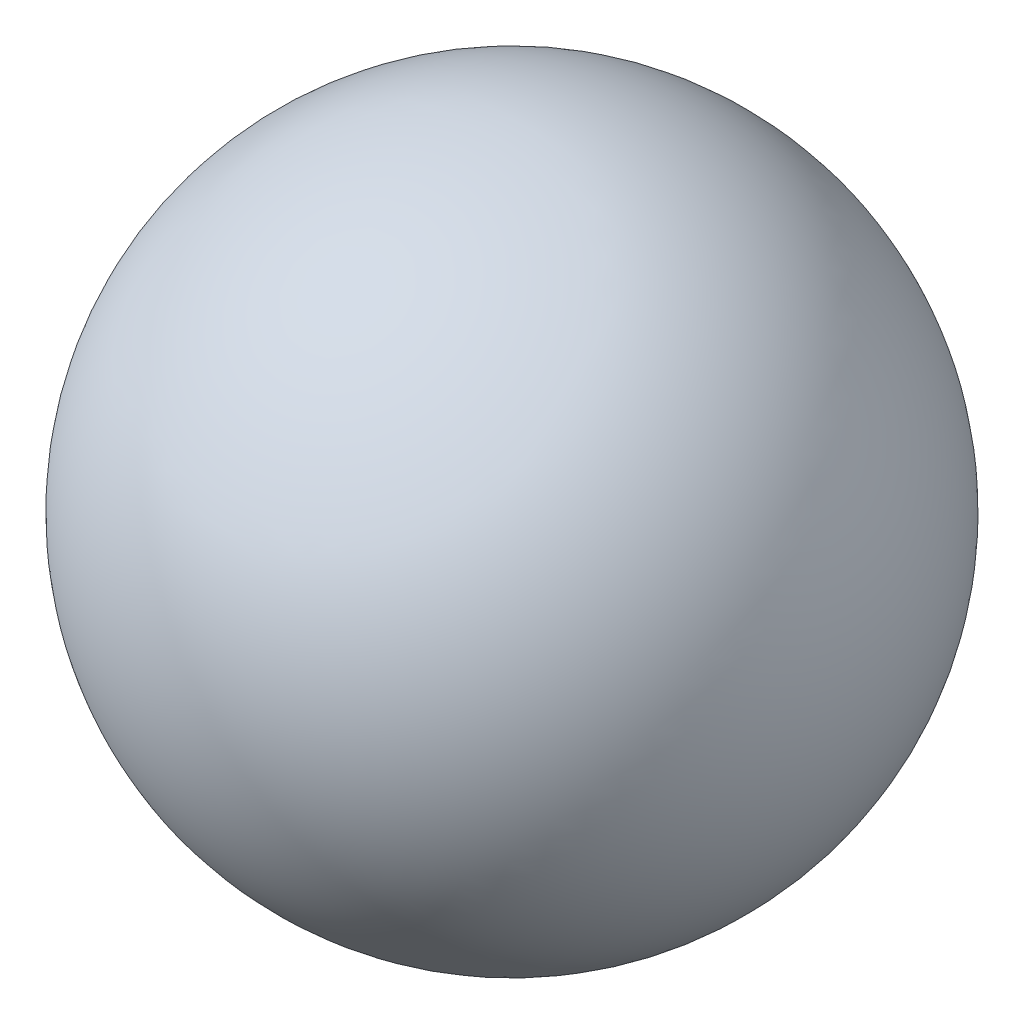
ISO-10303-21;
HEADER;
FILE_DESCRIPTION(('STEP AP214'),'2;1');
FILE_NAME('part.step','',(''),(''),'','','');
FILE_SCHEMA(('AUTOMOTIVE_DESIGN { 1 0 10303 214 1 1 1 1 }'));
ENDSEC;
DATA;
#1=APPLICATION_CONTEXT('core data for automotive mechanical design processes');
#2=APPLICATION_PROTOCOL_DEFINITION('international standard','automotive_design',2000,#1);
#3=PRODUCT_CONTEXT('',#1,'mechanical');
#4=PRODUCT('Part','Part','',(#3));
#5=PRODUCT_RELATED_PRODUCT_CATEGORY('part','',(#4));
#6=PRODUCT_DEFINITION_FORMATION('','',#4);
#7=PRODUCT_DEFINITION_CONTEXT('part definition',#1,'design');
#8=PRODUCT_DEFINITION('design','',#6,#7);
#9=PRODUCT_DEFINITION_SHAPE('','',#8);
#10=(LENGTH_UNIT() NAMED_UNIT(*) SI_UNIT(.MILLI.,.METRE.));
#11=(NAMED_UNIT(*) PLANE_ANGLE_UNIT() SI_UNIT($,.RADIAN.));
#12=(NAMED_UNIT(*) SI_UNIT($,.STERADIAN.) SOLID_ANGLE_UNIT());
#13=UNCERTAINTY_MEASURE_WITH_UNIT(LENGTH_MEASURE(1.E-05),#10,'distance_accuracy_value','');
#14=(GEOMETRIC_REPRESENTATION_CONTEXT(3) GLOBAL_UNCERTAINTY_ASSIGNED_CONTEXT((#13)) GLOBAL_UNIT_ASSIGNED_CONTEXT((#10,
#11,#12)) REPRESENTATION_CONTEXT('',''));
#15=CARTESIAN_POINT('',(0.,0.,0.));
#16=DIRECTION('',(0.,0.,1.));
#17=DIRECTION('',(1.,0.,0.));
#18=AXIS2_PLACEMENT_3D('',#15,#16,#17);
#19=CARTESIAN_POINT('',(0.,0.,0.));
#20=DIRECTION('',(0.,0.,-1.));
#21=DIRECTION('',(1.,0.,0.));
#22=AXIS2_PLACEMENT_3D('',#19,#20,#21);
#23=SPHERICAL_SURFACE('',#22,38.1);
#24=CARTESIAN_POINT('',(0.,0.,-38.1));
#25=VERTEX_POINT('',#24);
#26=VERTEX_LOOP('',#25);
#27=FACE_BOUND('',#26,.T.);
#28=ADVANCED_FACE('F31',(#27),#23,.T.);
#29=CLOSED_SHELL('',(#28));
#30=MANIFOLD_SOLID_BREP('B2',#29);
#31=ADVANCED_BREP_SHAPE_REPRESENTATION('',(#18,#30),#14);
#32=SHAPE_DEFINITION_REPRESENTATION(#9,#31);
ENDSEC;
END-ISO-10303-21;
